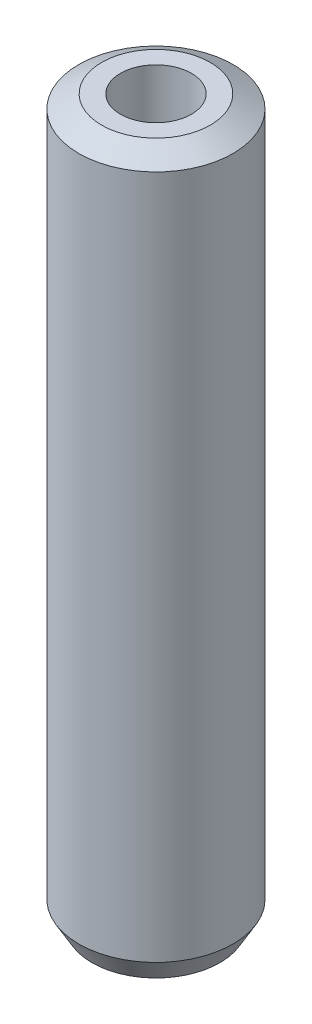
ISO-10303-21;
HEADER;
FILE_DESCRIPTION(('STEP AP214'),'2;1');
FILE_NAME('part.step','',(''),(''),'','','');
FILE_SCHEMA(('AUTOMOTIVE_DESIGN { 1 0 10303 214 1 1 1 1 }'));
ENDSEC;
DATA;
#1=APPLICATION_CONTEXT('core data for automotive mechanical design processes');
#2=APPLICATION_PROTOCOL_DEFINITION('international standard','automotive_design',2000,#1);
#3=PRODUCT_CONTEXT('',#1,'mechanical');
#4=PRODUCT('Part','Part','',(#3));
#5=PRODUCT_RELATED_PRODUCT_CATEGORY('part','',(#4));
#6=PRODUCT_DEFINITION_FORMATION('','',#4);
#7=PRODUCT_DEFINITION_CONTEXT('part definition',#1,'design');
#8=PRODUCT_DEFINITION('design','',#6,#7);
#9=PRODUCT_DEFINITION_SHAPE('','',#8);
#10=(LENGTH_UNIT() NAMED_UNIT(*) SI_UNIT(.MILLI.,.METRE.));
#11=(NAMED_UNIT(*) PLANE_ANGLE_UNIT() SI_UNIT($,.RADIAN.));
#12=(NAMED_UNIT(*) SI_UNIT($,.STERADIAN.) SOLID_ANGLE_UNIT());
#13=UNCERTAINTY_MEASURE_WITH_UNIT(LENGTH_MEASURE(1.E-05),#10,'distance_accuracy_value','');
#14=(GEOMETRIC_REPRESENTATION_CONTEXT(3) GLOBAL_UNCERTAINTY_ASSIGNED_CONTEXT((#13)) GLOBAL_UNIT_ASSIGNED_CONTEXT((#10,
#11,#12)) REPRESENTATION_CONTEXT('',''));
#15=CARTESIAN_POINT('',(0.,0.,0.));
#16=DIRECTION('',(0.,0.,1.));
#17=DIRECTION('',(1.,0.,0.));
#18=AXIS2_PLACEMENT_3D('',#15,#16,#17);
#19=CARTESIAN_POINT('',(0.,70.0509409874496,0.));
#20=DIRECTION('',(0.,-1.,0.));
#21=DIRECTION('',(0.,0.,-1.));
#22=AXIS2_PLACEMENT_3D('',#19,#20,#21);
#23=CYLINDRICAL_SURFACE('',#22,7.5);
#24=CARTESIAN_POINT('',(0.,68.7707692673115,0.));
#25=DIRECTION('',(0.,1.,0.));
#26=DIRECTION('',(0.,0.,1.));
#27=AXIS2_PLACEMENT_3D('',#24,#25,#26);
#28=CIRCLE('',#27,7.5);
#29=CARTESIAN_POINT('',(0.,68.7707692673115,7.5));
#30=VERTEX_POINT('',#29);
#31=EDGE_CURVE('E50',#30,#30,#28,.F.);
#32=ORIENTED_EDGE('',*,*,#31,.T.);
#33=EDGE_LOOP('',(#32));
#34=FACE_BOUND('',#33,.T.);
#35=CARTESIAN_POINT('',(0.,2.21732246169204,0.));
#36=DIRECTION('',(0.,1.,0.));
#37=DIRECTION('',(0.,0.,1.));
#38=AXIS2_PLACEMENT_3D('',#35,#36,#37);
#39=CIRCLE('',#38,7.5);
#40=CARTESIAN_POINT('',(0.,2.21732246169204,7.5));
#41=VERTEX_POINT('',#40);
#42=EDGE_CURVE('E51',#41,#41,#39,.T.);
#43=ORIENTED_EDGE('',*,*,#42,.T.);
#44=EDGE_LOOP('',(#43));
#45=FACE_BOUND('',#44,.T.);
#46=ADVANCED_FACE('F39',(#34,#45),#23,.T.);
#47=CARTESIAN_POINT('',(0.,70.0509409874496,0.));
#48=DIRECTION('',(0.,1.,0.));
#49=DIRECTION('',(0.,0.,1.));
#50=AXIS2_PLACEMENT_3D('',#47,#48,#49);
#51=PLANE('',#50);
#52=CARTESIAN_POINT('',(0.,70.0509409874496,0.));
#53=DIRECTION('',(0.,1.,0.));
#54=DIRECTION('',(0.,0.,1.));
#55=AXIS2_PLACEMENT_3D('',#52,#53,#54);
#56=CIRCLE('',#55,5.28267753830801);
#57=CARTESIAN_POINT('',(0.,70.0509409874496,5.28267753830801));
#58=VERTEX_POINT('',#57);
#59=EDGE_CURVE('E54',#58,#58,#56,.T.);
#60=ORIENTED_EDGE('',*,*,#59,.T.);
#61=EDGE_LOOP('',(#60));
#62=FACE_BOUND('',#61,.T.);
#63=CARTESIAN_POINT('',(0.,70.0509409874496,0.));
#64=DIRECTION('',(0.,1.,0.));
#65=DIRECTION('',(0.,0.,1.));
#66=AXIS2_PLACEMENT_3D('',#63,#64,#65);
#67=CIRCLE('',#66,3.45188599795857);
#68=CARTESIAN_POINT('',(0.,70.0509409874496,3.45188599795857));
#69=VERTEX_POINT('',#68);
#70=EDGE_CURVE('E58',#69,#69,#67,.T.);
#71=ORIENTED_EDGE('',*,*,#70,.F.);
#72=EDGE_LOOP('',(#71));
#73=FACE_BOUND('',#72,.T.);
#74=ADVANCED_FACE('F69',(#62,#73),#51,.T.);
#75=CARTESIAN_POINT('',(0.,0.,0.));
#76=DIRECTION('',(0.,1.,0.));
#77=DIRECTION('',(0.,0.,1.));
#78=AXIS2_PLACEMENT_3D('',#75,#76,#77);
#79=PLANE('',#78);
#80=CARTESIAN_POINT('',(0.,0.,0.));
#81=DIRECTION('',(0.,1.,0.));
#82=DIRECTION('',(0.,0.,1.));
#83=AXIS2_PLACEMENT_3D('',#80,#81,#82);
#84=CIRCLE('',#83,6.21982827986189);
#85=CARTESIAN_POINT('',(0.,0.,6.21982827986189));
#86=VERTEX_POINT('',#85);
#87=EDGE_CURVE('E10',#86,#86,#84,.F.);
#88=ORIENTED_EDGE('',*,*,#87,.T.);
#89=EDGE_LOOP('',(#88));
#90=FACE_BOUND('',#89,.T.);
#91=CARTESIAN_POINT('',(0.,0.,0.));
#92=DIRECTION('',(0.,1.,0.));
#93=DIRECTION('',(0.,0.,1.));
#94=AXIS2_PLACEMENT_3D('',#91,#92,#93);
#95=CIRCLE('',#94,3.45188599795857);
#96=CARTESIAN_POINT('',(0.,0.,3.45188599795857));
#97=VERTEX_POINT('',#96);
#98=EDGE_CURVE('E63',#97,#97,#95,.T.);
#99=ORIENTED_EDGE('',*,*,#98,.T.);
#100=EDGE_LOOP('',(#99));
#101=FACE_BOUND('',#100,.T.);
#102=ADVANCED_FACE('F75',(#90,#101),#79,.F.);
#103=CARTESIAN_POINT('',(0.,70.0509409874496,0.));
#104=DIRECTION('',(0.,-1.,0.));
#105=DIRECTION('',(0.,0.,-1.));
#106=AXIS2_PLACEMENT_3D('',#103,#104,#105);
#107=CYLINDRICAL_SURFACE('',#106,3.45188599795857);
#108=ORIENTED_EDGE('',*,*,#70,.T.);
#109=EDGE_LOOP('',(#108));
#110=FACE_BOUND('',#109,.T.);
#111=ORIENTED_EDGE('',*,*,#98,.F.);
#112=EDGE_LOOP('',(#111));
#113=FACE_BOUND('',#112,.T.);
#114=ADVANCED_FACE('F70',(#110,#113),#107,.F.);
#115=CARTESIAN_POINT('',(0.,70.0509409874496,0.));
#116=DIRECTION('',(0.,-1.,0.));
#117=DIRECTION('',(0.,0.,-1.));
#118=AXIS2_PLACEMENT_3D('',#115,#116,#117);
#119=CONICAL_SURFACE('',#118,5.28267753830801,1.04719755119659);
#120=ORIENTED_EDGE('',*,*,#31,.F.);
#121=EDGE_LOOP('',(#120));
#122=FACE_BOUND('',#121,.T.);
#123=ORIENTED_EDGE('',*,*,#59,.F.);
#124=EDGE_LOOP('',(#123));
#125=FACE_BOUND('',#124,.T.);
#126=ADVANCED_FACE('F81',(#122,#125),#119,.T.);
#127=CARTESIAN_POINT('',(0.,2.21732246169204,0.));
#128=DIRECTION('',(0.,1.,0.));
#129=DIRECTION('',(0.,0.,1.));
#130=AXIS2_PLACEMENT_3D('',#127,#128,#129);
#131=CONICAL_SURFACE('',#130,7.5,0.523598775598301);
#132=ORIENTED_EDGE('',*,*,#87,.F.);
#133=EDGE_LOOP('',(#132));
#134=FACE_BOUND('',#133,.T.);
#135=ORIENTED_EDGE('',*,*,#42,.F.);
#136=EDGE_LOOP('',(#135));
#137=FACE_BOUND('',#136,.T.);
#138=ADVANCED_FACE('F45',(#134,#137),#131,.T.);
#139=CLOSED_SHELL('',(#46,#74,#102,#114,#126,#138));
#140=MANIFOLD_SOLID_BREP('B2',#139);
#141=ADVANCED_BREP_SHAPE_REPRESENTATION('',(#18,#140),#14);
#142=SHAPE_DEFINITION_REPRESENTATION(#9,#141);
ENDSEC;
END-ISO-10303-21;
